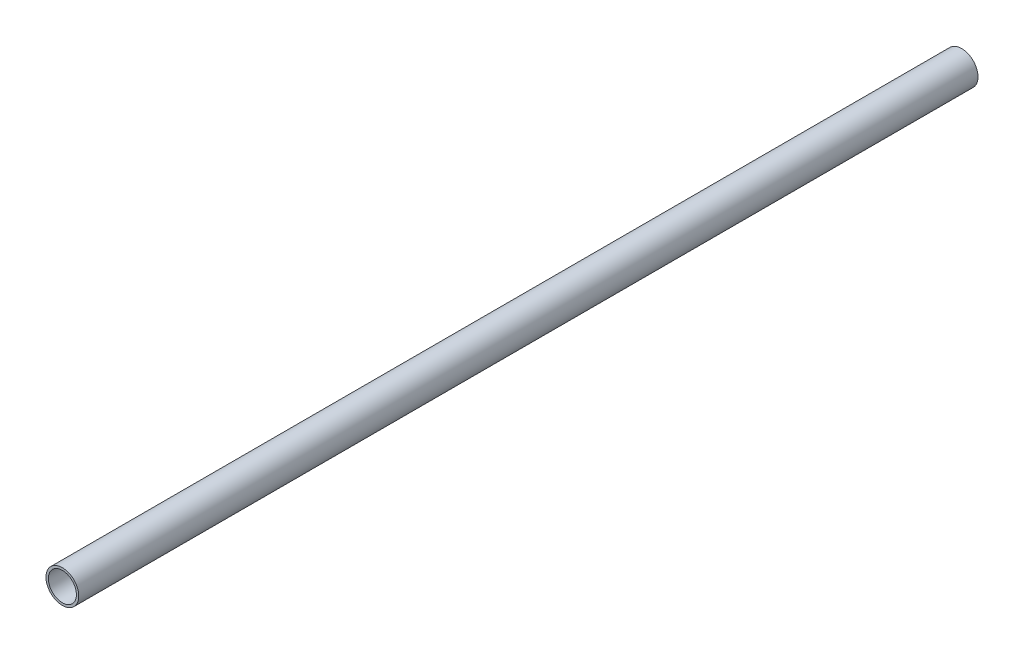
ISO-10303-21;
HEADER;
FILE_DESCRIPTION(('STEP AP214'),'2;1');
FILE_NAME('part.step','',(''),(''),'','','');
FILE_SCHEMA(('AUTOMOTIVE_DESIGN { 1 0 10303 214 1 1 1 1 }'));
ENDSEC;
DATA;
#1=APPLICATION_CONTEXT('core data for automotive mechanical design processes');
#2=APPLICATION_PROTOCOL_DEFINITION('international standard','automotive_design',2000,#1);
#3=PRODUCT_CONTEXT('',#1,'mechanical');
#4=PRODUCT('Part','Part','',(#3));
#5=PRODUCT_RELATED_PRODUCT_CATEGORY('part','',(#4));
#6=PRODUCT_DEFINITION_FORMATION('','',#4);
#7=PRODUCT_DEFINITION_CONTEXT('part definition',#1,'design');
#8=PRODUCT_DEFINITION('design','',#6,#7);
#9=PRODUCT_DEFINITION_SHAPE('','',#8);
#10=(LENGTH_UNIT() NAMED_UNIT(*) SI_UNIT(.MILLI.,.METRE.));
#11=(NAMED_UNIT(*) PLANE_ANGLE_UNIT() SI_UNIT($,.RADIAN.));
#12=(NAMED_UNIT(*) SI_UNIT($,.STERADIAN.) SOLID_ANGLE_UNIT());
#13=UNCERTAINTY_MEASURE_WITH_UNIT(LENGTH_MEASURE(1.E-05),#10,'distance_accuracy_value','');
#14=(GEOMETRIC_REPRESENTATION_CONTEXT(3) GLOBAL_UNCERTAINTY_ASSIGNED_CONTEXT((#13)) GLOBAL_UNIT_ASSIGNED_CONTEXT((#10,
#11,#12)) REPRESENTATION_CONTEXT('',''));
#15=CARTESIAN_POINT('',(0.,0.,0.));
#16=DIRECTION('',(0.,0.,1.));
#17=DIRECTION('',(1.,0.,0.));
#18=AXIS2_PLACEMENT_3D('',#15,#16,#17);
#19=CARTESIAN_POINT('',(0.,0.,304.8));
#20=DIRECTION('',(0.,0.,1.));
#21=DIRECTION('',(1.,0.,0.));
#22=AXIS2_PLACEMENT_3D('',#19,#20,#21);
#23=PLANE('',#22);
#24=CARTESIAN_POINT('',(0.,0.,304.8));
#25=DIRECTION('',(0.,0.,1.));
#26=DIRECTION('',(1.,0.,0.));
#27=AXIS2_PLACEMENT_3D('',#24,#25,#26);
#28=CIRCLE('',#27,11.1125);
#29=CARTESIAN_POINT('',(11.1125,0.,304.8));
#30=VERTEX_POINT('',#29);
#31=EDGE_CURVE('E10',#30,#30,#28,.T.);
#32=ORIENTED_EDGE('',*,*,#31,.T.);
#33=EDGE_LOOP('',(#32));
#34=FACE_BOUND('',#33,.T.);
#35=CARTESIAN_POINT('',(0.,0.,304.8));
#36=DIRECTION('',(0.,0.,1.));
#37=DIRECTION('',(1.,0.,0.));
#38=AXIS2_PLACEMENT_3D('',#35,#36,#37);
#39=CIRCLE('',#38,9.525);
#40=CARTESIAN_POINT('',(9.525,0.,304.8));
#41=VERTEX_POINT('',#40);
#42=EDGE_CURVE('E50',#41,#41,#39,.T.);
#43=ORIENTED_EDGE('',*,*,#42,.F.);
#44=EDGE_LOOP('',(#43));
#45=FACE_BOUND('',#44,.T.);
#46=ADVANCED_FACE('F37',(#34,#45),#23,.T.);
#47=CARTESIAN_POINT('',(0.,0.,-304.8));
#48=DIRECTION('',(0.,0.,1.));
#49=DIRECTION('',(1.,0.,0.));
#50=AXIS2_PLACEMENT_3D('',#47,#48,#49);
#51=PLANE('',#50);
#52=CARTESIAN_POINT('',(0.,0.,-304.8));
#53=DIRECTION('',(0.,0.,1.));
#54=DIRECTION('',(1.,0.,0.));
#55=AXIS2_PLACEMENT_3D('',#52,#53,#54);
#56=CIRCLE('',#55,11.1125);
#57=CARTESIAN_POINT('',(11.1125,0.,-304.8));
#58=VERTEX_POINT('',#57);
#59=EDGE_CURVE('E41',#58,#58,#56,.T.);
#60=ORIENTED_EDGE('',*,*,#59,.F.);
#61=EDGE_LOOP('',(#60));
#62=FACE_BOUND('',#61,.T.);
#63=CARTESIAN_POINT('',(0.,0.,-304.8));
#64=DIRECTION('',(0.,0.,1.));
#65=DIRECTION('',(1.,0.,0.));
#66=AXIS2_PLACEMENT_3D('',#63,#64,#65);
#67=CIRCLE('',#66,9.525);
#68=CARTESIAN_POINT('',(9.525,0.,-304.8));
#69=VERTEX_POINT('',#68);
#70=EDGE_CURVE('E52',#69,#69,#67,.T.);
#71=ORIENTED_EDGE('',*,*,#70,.T.);
#72=EDGE_LOOP('',(#71));
#73=FACE_BOUND('',#72,.T.);
#74=ADVANCED_FACE('F64',(#62,#73),#51,.F.);
#75=CARTESIAN_POINT('',(0.,0.,304.8));
#76=DIRECTION('',(0.,0.,-1.));
#77=DIRECTION('',(-1.,0.,0.));
#78=AXIS2_PLACEMENT_3D('',#75,#76,#77);
#79=CYLINDRICAL_SURFACE('',#78,11.1125);
#80=ORIENTED_EDGE('',*,*,#31,.F.);
#81=EDGE_LOOP('',(#80));
#82=FACE_BOUND('',#81,.T.);
#83=ORIENTED_EDGE('',*,*,#59,.T.);
#84=EDGE_LOOP('',(#83));
#85=FACE_BOUND('',#84,.T.);
#86=ADVANCED_FACE('F39',(#82,#85),#79,.T.);
#87=CARTESIAN_POINT('',(0.,0.,304.8));
#88=DIRECTION('',(0.,0.,-1.));
#89=DIRECTION('',(-1.,0.,0.));
#90=AXIS2_PLACEMENT_3D('',#87,#88,#89);
#91=CYLINDRICAL_SURFACE('',#90,9.525);
#92=ORIENTED_EDGE('',*,*,#42,.T.);
#93=EDGE_LOOP('',(#92));
#94=FACE_BOUND('',#93,.T.);
#95=ORIENTED_EDGE('',*,*,#70,.F.);
#96=EDGE_LOOP('',(#95));
#97=FACE_BOUND('',#96,.T.);
#98=ADVANCED_FACE('F60',(#94,#97),#91,.F.);
#99=CLOSED_SHELL('',(#46,#74,#86,#98));
#100=MANIFOLD_SOLID_BREP('B2',#99);
#101=ADVANCED_BREP_SHAPE_REPRESENTATION('',(#18,#100),#14);
#102=SHAPE_DEFINITION_REPRESENTATION(#9,#101);
ENDSEC;
END-ISO-10303-21;
